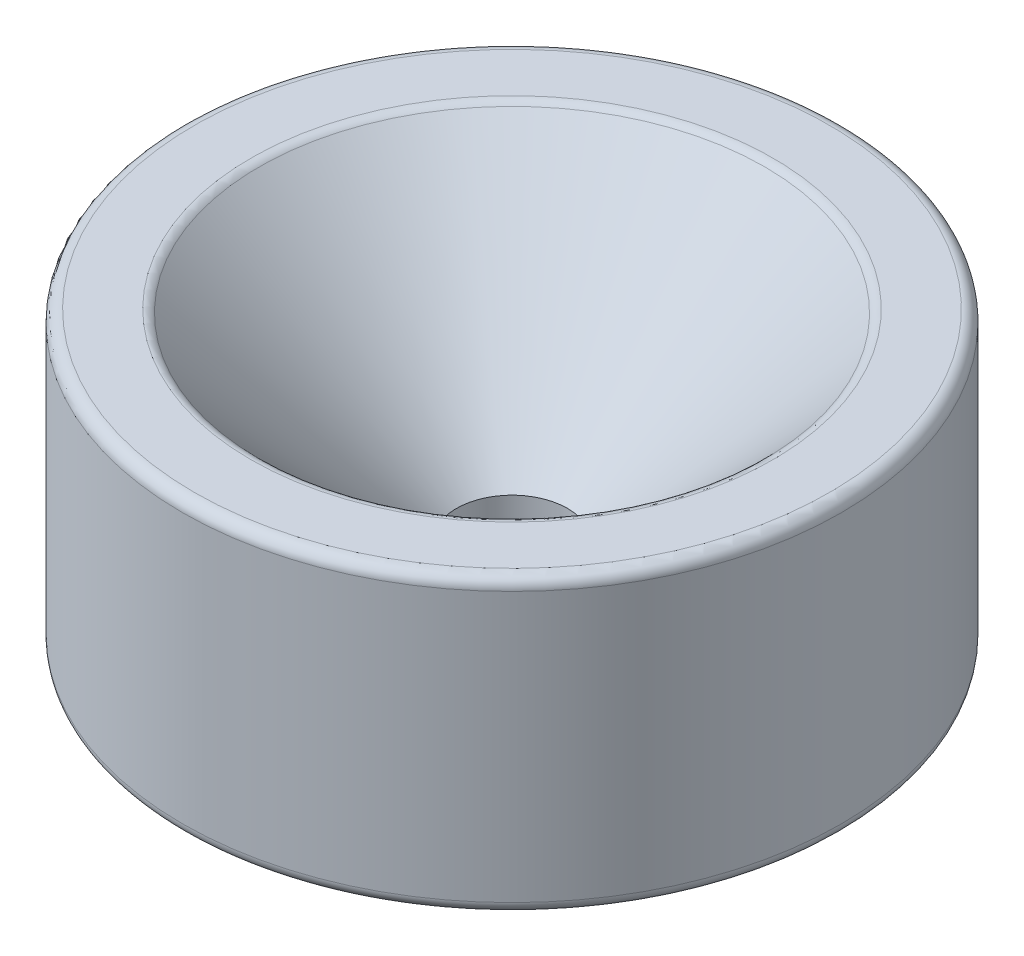
ISO-10303-21;
HEADER;
FILE_DESCRIPTION(('STEP AP214'),'2;1');
FILE_NAME('part.step','',(''),(''),'','','');
FILE_SCHEMA(('AUTOMOTIVE_DESIGN { 1 0 10303 214 1 1 1 1 }'));
ENDSEC;
DATA;
#1=APPLICATION_CONTEXT('core data for automotive mechanical design processes');
#2=APPLICATION_PROTOCOL_DEFINITION('international standard','automotive_design',2000,#1);
#3=PRODUCT_CONTEXT('',#1,'mechanical');
#4=PRODUCT('Part','Part','',(#3));
#5=PRODUCT_RELATED_PRODUCT_CATEGORY('part','',(#4));
#6=PRODUCT_DEFINITION_FORMATION('','',#4);
#7=PRODUCT_DEFINITION_CONTEXT('part definition',#1,'design');
#8=PRODUCT_DEFINITION('design','',#6,#7);
#9=PRODUCT_DEFINITION_SHAPE('','',#8);
#10=(LENGTH_UNIT() NAMED_UNIT(*) SI_UNIT(.MILLI.,.METRE.));
#11=(NAMED_UNIT(*) PLANE_ANGLE_UNIT() SI_UNIT($,.RADIAN.));
#12=(NAMED_UNIT(*) SI_UNIT($,.STERADIAN.) SOLID_ANGLE_UNIT());
#13=UNCERTAINTY_MEASURE_WITH_UNIT(LENGTH_MEASURE(1.E-05),#10,'distance_accuracy_value','');
#14=(GEOMETRIC_REPRESENTATION_CONTEXT(3) GLOBAL_UNCERTAINTY_ASSIGNED_CONTEXT((#13)) GLOBAL_UNIT_ASSIGNED_CONTEXT((#10,
#11,#12)) REPRESENTATION_CONTEXT('',''));
#15=CARTESIAN_POINT('',(0.,0.,0.));
#16=DIRECTION('',(0.,0.,1.));
#17=DIRECTION('',(1.,0.,0.));
#18=AXIS2_PLACEMENT_3D('',#15,#16,#17);
#19=CARTESIAN_POINT('',(0.,0.762,0.));
#20=DIRECTION('',(0.,-1.,0.));
#21=DIRECTION('',(0.,0.,-1.));
#22=AXIS2_PLACEMENT_3D('',#19,#20,#21);
#23=CONICAL_SURFACE('',#22,8.763,0.785398163397447);
#24=CARTESIAN_POINT('',(0.,0.,0.));
#25=DIRECTION('',(0.,-1.,0.));
#26=DIRECTION('',(0.,0.,-1.));
#27=AXIS2_PLACEMENT_3D('',#24,#25,#26);
#28=CIRCLE('',#27,9.525);
#29=CARTESIAN_POINT('',(0.,0.,-9.525));
#30=VERTEX_POINT('',#29);
#31=EDGE_CURVE('E66',#30,#30,#28,.T.);
#32=ORIENTED_EDGE('',*,*,#31,.T.);
#33=EDGE_LOOP('',(#32));
#34=FACE_BOUND('',#33,.T.);
#35=CARTESIAN_POINT('',(0.,0.762,0.));
#36=DIRECTION('',(0.,-1.,0.));
#37=DIRECTION('',(0.,0.,-1.));
#38=AXIS2_PLACEMENT_3D('',#35,#36,#37);
#39=CIRCLE('',#38,8.763);
#40=CARTESIAN_POINT('',(0.,0.762,-8.763));
#41=VERTEX_POINT('',#40);
#42=EDGE_CURVE('E60',#41,#41,#39,.T.);
#43=ORIENTED_EDGE('',*,*,#42,.F.);
#44=EDGE_LOOP('',(#43));
#45=FACE_BOUND('',#44,.T.);
#46=ADVANCED_FACE('F29',(#34,#45),#23,.F.);
#47=CARTESIAN_POINT('',(2.413,0.762,0.));
#48=DIRECTION('',(0.,-1.,0.));
#49=DIRECTION('',(0.,0.,-1.));
#50=AXIS2_PLACEMENT_3D('',#47,#48,#49);
#51=PLANE('',#50);
#52=CARTESIAN_POINT('',(0.,0.762,0.));
#53=DIRECTION('',(0.,-1.,0.));
#54=DIRECTION('',(0.,0.,-1.));
#55=AXIS2_PLACEMENT_3D('',#52,#53,#54);
#56=CIRCLE('',#55,2.79400000000001);
#57=CARTESIAN_POINT('',(0.,0.762,-2.79400000000001));
#58=VERTEX_POINT('',#57);
#59=EDGE_CURVE('E54',#58,#58,#56,.F.);
#60=ORIENTED_EDGE('',*,*,#59,.T.);
#61=EDGE_LOOP('',(#60));
#62=FACE_BOUND('',#61,.T.);
#63=ORIENTED_EDGE('',*,*,#42,.T.);
#64=EDGE_LOOP('',(#63));
#65=FACE_BOUND('',#64,.T.);
#66=ADVANCED_FACE('F89',(#62,#65),#51,.T.);
#67=CARTESIAN_POINT('',(0.,0.,0.));
#68=DIRECTION('',(0.,-1.,0.));
#69=DIRECTION('',(0.,0.,-1.));
#70=AXIS2_PLACEMENT_3D('',#67,#68,#69);
#71=CYLINDRICAL_SURFACE('',#70,2.413);
#72=CARTESIAN_POINT('',(0.,1.14300000000001,0.));
#73=DIRECTION('',(0.,-1.,0.));
#74=DIRECTION('',(0.,0.,-1.));
#75=AXIS2_PLACEMENT_3D('',#72,#73,#74);
#76=CIRCLE('',#75,2.413);
#77=CARTESIAN_POINT('',(0.,1.14300000000001,-2.413));
#78=VERTEX_POINT('',#77);
#79=EDGE_CURVE('E57',#78,#78,#76,.T.);
#80=ORIENTED_EDGE('',*,*,#79,.T.);
#81=EDGE_LOOP('',(#80));
#82=FACE_BOUND('',#81,.T.);
#83=CARTESIAN_POINT('',(0.,4.00049999999991,0.));
#84=DIRECTION('',(0.,-1.,0.));
#85=DIRECTION('',(0.,0.,-1.));
#86=AXIS2_PLACEMENT_3D('',#83,#84,#85);
#87=CIRCLE('',#86,2.413);
#88=CARTESIAN_POINT('',(0.,4.00049999999991,-2.413));
#89=VERTEX_POINT('',#88);
#90=EDGE_CURVE('E63',#89,#89,#87,.T.);
#91=ORIENTED_EDGE('',*,*,#90,.F.);
#92=EDGE_LOOP('',(#91));
#93=FACE_BOUND('',#92,.T.);
#94=ADVANCED_FACE('F93',(#82,#93),#71,.F.);
#95=CARTESIAN_POINT('',(0.,12.7,0.));
#96=DIRECTION('',(0.,1.,0.));
#97=DIRECTION('',(0.,0.,1.));
#98=AXIS2_PLACEMENT_3D('',#95,#96,#97);
#99=CONICAL_SURFACE('',#98,11.1125,0.785398163397443);
#100=CARTESIAN_POINT('',(0.,12.5512102448428,0.));
#101=DIRECTION('',(0.,-1.,0.));
#102=DIRECTION('',(0.,0.,-1.));
#103=AXIS2_PLACEMENT_3D('',#100,#101,#102);
#104=CIRCLE('',#103,10.9637102448428);
#105=CARTESIAN_POINT('',(0.,12.5512102448428,-10.9637102448428));
#106=VERTEX_POINT('',#105);
#107=EDGE_CURVE('E10',#106,#106,#104,.F.);
#108=ORIENTED_EDGE('',*,*,#107,.T.);
#109=EDGE_LOOP('',(#108));
#110=FACE_BOUND('',#109,.T.);
#111=ORIENTED_EDGE('',*,*,#90,.T.);
#112=EDGE_LOOP('',(#111));
#113=FACE_BOUND('',#112,.T.);
#114=ADVANCED_FACE('F98',(#110,#113),#99,.F.);
#115=CARTESIAN_POINT('',(14.2875,12.7,0.));
#116=DIRECTION('',(0.,1.,0.));
#117=DIRECTION('',(0.,0.,1.));
#118=AXIS2_PLACEMENT_3D('',#115,#116,#117);
#119=PLANE('',#118);
#120=CARTESIAN_POINT('',(0.,12.7,0.));
#121=DIRECTION('',(0.,1.,0.));
#122=DIRECTION('',(0.,0.,1.));
#123=AXIS2_PLACEMENT_3D('',#120,#121,#122);
#124=CIRCLE('',#123,13.7795);
#125=CARTESIAN_POINT('',(0.,12.7,13.7795));
#126=VERTEX_POINT('',#125);
#127=EDGE_CURVE('E35',#126,#126,#124,.T.);
#128=ORIENTED_EDGE('',*,*,#127,.T.);
#129=EDGE_LOOP('',(#128));
#130=FACE_BOUND('',#129,.T.);
#131=CARTESIAN_POINT('',(0.,12.7,0.));
#132=DIRECTION('',(0.,1.,0.));
#133=DIRECTION('',(0.,0.,1.));
#134=AXIS2_PLACEMENT_3D('',#131,#132,#133);
#135=CIRCLE('',#134,11.3229204896855);
#136=CARTESIAN_POINT('',(0.,12.7,11.3229204896855));
#137=VERTEX_POINT('',#136);
#138=EDGE_CURVE('E39',#137,#137,#135,.F.);
#139=ORIENTED_EDGE('',*,*,#138,.T.);
#140=EDGE_LOOP('',(#139));
#141=FACE_BOUND('',#140,.T.);
#142=ADVANCED_FACE('F85',(#130,#141),#119,.T.);
#143=CARTESIAN_POINT('',(0.,0.,0.));
#144=DIRECTION('',(0.,-1.,0.));
#145=DIRECTION('',(0.,0.,-1.));
#146=AXIS2_PLACEMENT_3D('',#143,#144,#145);
#147=CYLINDRICAL_SURFACE('',#146,14.2875);
#148=CARTESIAN_POINT('',(0.,0.508,0.));
#149=DIRECTION('',(0.,-1.,0.));
#150=DIRECTION('',(0.,0.,-1.));
#151=AXIS2_PLACEMENT_3D('',#148,#149,#150);
#152=CIRCLE('',#151,14.2875);
#153=CARTESIAN_POINT('',(0.,0.508,-14.2875));
#154=VERTEX_POINT('',#153);
#155=EDGE_CURVE('E43',#154,#154,#152,.F.);
#156=ORIENTED_EDGE('',*,*,#155,.T.);
#157=EDGE_LOOP('',(#156));
#158=FACE_BOUND('',#157,.T.);
#159=CARTESIAN_POINT('',(0.,12.192,0.));
#160=DIRECTION('',(0.,1.,0.));
#161=DIRECTION('',(0.,0.,1.));
#162=AXIS2_PLACEMENT_3D('',#159,#160,#161);
#163=CIRCLE('',#162,14.2875);
#164=CARTESIAN_POINT('',(0.,12.192,14.2875));
#165=VERTEX_POINT('',#164);
#166=EDGE_CURVE('E48',#165,#165,#163,.F.);
#167=ORIENTED_EDGE('',*,*,#166,.T.);
#168=EDGE_LOOP('',(#167));
#169=FACE_BOUND('',#168,.T.);
#170=ADVANCED_FACE('F75',(#158,#169),#147,.T.);
#171=CARTESIAN_POINT('',(9.525,0.,0.));
#172=DIRECTION('',(0.,-1.,0.));
#173=DIRECTION('',(0.,0.,-1.));
#174=AXIS2_PLACEMENT_3D('',#171,#172,#173);
#175=PLANE('',#174);
#176=CARTESIAN_POINT('',(0.,0.,0.));
#177=DIRECTION('',(0.,-1.,0.));
#178=DIRECTION('',(0.,0.,-1.));
#179=AXIS2_PLACEMENT_3D('',#176,#177,#178);
#180=CIRCLE('',#179,13.7795);
#181=CARTESIAN_POINT('',(0.,0.,-13.7795));
#182=VERTEX_POINT('',#181);
#183=EDGE_CURVE('E51',#182,#182,#180,.T.);
#184=ORIENTED_EDGE('',*,*,#183,.T.);
#185=EDGE_LOOP('',(#184));
#186=FACE_BOUND('',#185,.T.);
#187=ORIENTED_EDGE('',*,*,#31,.F.);
#188=EDGE_LOOP('',(#187));
#189=FACE_BOUND('',#188,.T.);
#190=ADVANCED_FACE('F72',(#186,#189),#175,.T.);
#191=CARTESIAN_POINT('',(0.,1.14300000000001,0.));
#192=DIRECTION('',(0.,-1.,0.));
#193=DIRECTION('',(0.,0.,-1.));
#194=AXIS2_PLACEMENT_3D('',#191,#192,#193);
#195=CONICAL_SURFACE('',#194,2.413,0.785398163397452);
#196=ORIENTED_EDGE('',*,*,#59,.F.);
#197=EDGE_LOOP('',(#196));
#198=FACE_BOUND('',#197,.T.);
#199=ORIENTED_EDGE('',*,*,#79,.F.);
#200=EDGE_LOOP('',(#199));
#201=FACE_BOUND('',#200,.T.);
#202=ADVANCED_FACE('F74',(#198,#201),#195,.F.);
#203=CARTESIAN_POINT('',(0.,0.508,0.));
#204=DIRECTION('',(0.,-1.,0.));
#205=DIRECTION('',(0.,0.,-1.));
#206=AXIS2_PLACEMENT_3D('',#203,#204,#205);
#207=TOROIDAL_SURFACE('',#206,13.7795,0.508);
#208=ORIENTED_EDGE('',*,*,#155,.F.);
#209=EDGE_LOOP('',(#208));
#210=FACE_BOUND('',#209,.T.);
#211=ORIENTED_EDGE('',*,*,#183,.F.);
#212=EDGE_LOOP('',(#211));
#213=FACE_BOUND('',#212,.T.);
#214=ADVANCED_FACE('F82',(#210,#213),#207,.T.);
#215=CARTESIAN_POINT('',(0.,12.192,0.));
#216=DIRECTION('',(0.,1.,0.));
#217=DIRECTION('',(0.,0.,1.));
#218=AXIS2_PLACEMENT_3D('',#215,#216,#217);
#219=TOROIDAL_SURFACE('',#218,13.7795,0.508);
#220=ORIENTED_EDGE('',*,*,#127,.F.);
#221=EDGE_LOOP('',(#220));
#222=FACE_BOUND('',#221,.T.);
#223=ORIENTED_EDGE('',*,*,#166,.F.);
#224=EDGE_LOOP('',(#223));
#225=FACE_BOUND('',#224,.T.);
#226=ADVANCED_FACE('F113',(#222,#225),#219,.T.);
#227=CARTESIAN_POINT('',(0.,12.192,0.));
#228=DIRECTION('',(0.,1.,0.));
#229=DIRECTION('',(0.,0.,1.));
#230=AXIS2_PLACEMENT_3D('',#227,#228,#229);
#231=TOROIDAL_SURFACE('',#230,11.3229204896855,0.508);
#232=ORIENTED_EDGE('',*,*,#107,.F.);
#233=EDGE_LOOP('',(#232));
#234=FACE_BOUND('',#233,.T.);
#235=ORIENTED_EDGE('',*,*,#138,.F.);
#236=EDGE_LOOP('',(#235));
#237=FACE_BOUND('',#236,.T.);
#238=ADVANCED_FACE('F111',(#234,#237),#231,.T.);
#239=CLOSED_SHELL('',(#46,#66,#94,#114,#142,#170,#190,#202,#214,#226,#238));
#240=MANIFOLD_SOLID_BREP('B2',#239);
#241=ADVANCED_BREP_SHAPE_REPRESENTATION('',(#18,#240),#14);
#242=SHAPE_DEFINITION_REPRESENTATION(#9,#241);
ENDSEC;
END-ISO-10303-21;
